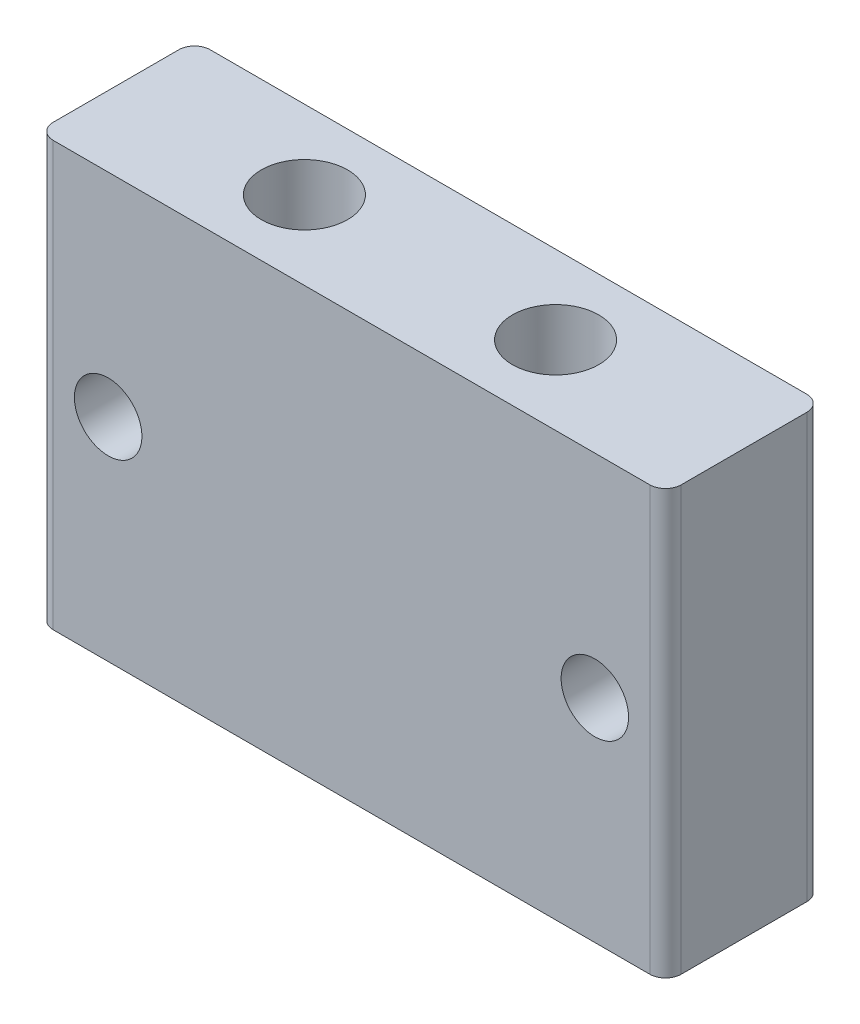
ISO-10303-21;
HEADER;
FILE_DESCRIPTION(('STEP AP214'),'2;1');
FILE_NAME('part.step','',(''),(''),'','','');
FILE_SCHEMA(('AUTOMOTIVE_DESIGN { 1 0 10303 214 1 1 1 1 }'));
ENDSEC;
DATA;
#1=APPLICATION_CONTEXT('core data for automotive mechanical design processes');
#2=APPLICATION_PROTOCOL_DEFINITION('international standard','automotive_design',2000,#1);
#3=PRODUCT_CONTEXT('',#1,'mechanical');
#4=PRODUCT('Part','Part','',(#3));
#5=PRODUCT_RELATED_PRODUCT_CATEGORY('part','',(#4));
#6=PRODUCT_DEFINITION_FORMATION('','',#4);
#7=PRODUCT_DEFINITION_CONTEXT('part definition',#1,'design');
#8=PRODUCT_DEFINITION('design','',#6,#7);
#9=PRODUCT_DEFINITION_SHAPE('','',#8);
#10=(LENGTH_UNIT() NAMED_UNIT(*) SI_UNIT(.MILLI.,.METRE.));
#11=(NAMED_UNIT(*) PLANE_ANGLE_UNIT() SI_UNIT($,.RADIAN.));
#12=(NAMED_UNIT(*) SI_UNIT($,.STERADIAN.) SOLID_ANGLE_UNIT());
#13=UNCERTAINTY_MEASURE_WITH_UNIT(LENGTH_MEASURE(1.E-05),#10,'distance_accuracy_value','');
#14=(GEOMETRIC_REPRESENTATION_CONTEXT(3) GLOBAL_UNCERTAINTY_ASSIGNED_CONTEXT((#13)) GLOBAL_UNIT_ASSIGNED_CONTEXT((#10,
#11,#12)) REPRESENTATION_CONTEXT('',''));
#15=CARTESIAN_POINT('',(0.,0.,0.));
#16=DIRECTION('',(0.,0.,1.));
#17=DIRECTION('',(1.,0.,0.));
#18=AXIS2_PLACEMENT_3D('',#15,#16,#17);
#19=CARTESIAN_POINT('',(0.,27.,0.));
#20=DIRECTION('',(1.,0.,0.));
#21=DIRECTION('',(0.,0.,-1.));
#22=AXIS2_PLACEMENT_3D('',#19,#20,#21);
#23=PLANE('',#22);
#24=DIRECTION('',(0.,0.,1.));
#25=VECTOR('',#24,1.);
#26=CARTESIAN_POINT('',(0.,27.,0.));
#27=LINE('',#26,#25);
#28=CARTESIAN_POINT('',(0.,27.,-9.));
#29=VERTEX_POINT('',#28);
#30=CARTESIAN_POINT('',(0.,27.,-1.));
#31=VERTEX_POINT('',#30);
#32=EDGE_CURVE('E129',#29,#31,#27,.T.);
#33=ORIENTED_EDGE('',*,*,#32,.F.);
#34=DIRECTION('',(0.,-1.,0.));
#35=VECTOR('',#34,1.);
#36=CARTESIAN_POINT('',(0.,27.,-9.));
#37=LINE('',#36,#35);
#38=CARTESIAN_POINT('',(0.,0.,-9.));
#39=VERTEX_POINT('',#38);
#40=EDGE_CURVE('E11',#29,#39,#37,.T.);
#41=ORIENTED_EDGE('',*,*,#40,.T.);
#42=DIRECTION('',(0.,0.,1.));
#43=VECTOR('',#42,1.);
#44=CARTESIAN_POINT('',(0.,0.,0.));
#45=LINE('',#44,#43);
#46=CARTESIAN_POINT('',(0.,0.,-1.));
#47=VERTEX_POINT('',#46);
#48=EDGE_CURVE('E145',#39,#47,#45,.T.);
#49=ORIENTED_EDGE('',*,*,#48,.T.);
#50=DIRECTION('',(0.,-1.,0.));
#51=VECTOR('',#50,1.);
#52=CARTESIAN_POINT('',(0.,27.,-1.));
#53=LINE('',#52,#51);
#54=EDGE_CURVE('E43',#47,#31,#53,.F.);
#55=ORIENTED_EDGE('',*,*,#54,.T.);
#56=EDGE_LOOP('',(#33,#41,#49,#55));
#57=FACE_BOUND('',#56,.T.);
#58=ADVANCED_FACE('F35',(#57),#23,.F.);
#59=CARTESIAN_POINT('',(0.,27.,0.));
#60=DIRECTION('',(0.,0.,-1.));
#61=DIRECTION('',(-1.,0.,0.));
#62=AXIS2_PLACEMENT_3D('',#59,#60,#61);
#63=PLANE('',#62);
#64=CARTESIAN_POINT('',(35.5,13.5,0.));
#65=DIRECTION('',(0.,0.,-1.));
#66=DIRECTION('',(-1.,0.,0.));
#67=AXIS2_PLACEMENT_3D('',#64,#65,#66);
#68=CIRCLE('',#67,2.15);
#69=CARTESIAN_POINT('',(33.35,13.5,0.));
#70=VERTEX_POINT('',#69);
#71=EDGE_CURVE('E142',#70,#70,#68,.T.);
#72=ORIENTED_EDGE('',*,*,#71,.T.);
#73=EDGE_LOOP('',(#72));
#74=FACE_BOUND('',#73,.T.);
#75=CARTESIAN_POINT('',(4.49999999999999,13.5,0.));
#76=DIRECTION('',(0.,0.,-1.));
#77=DIRECTION('',(-1.,0.,0.));
#78=AXIS2_PLACEMENT_3D('',#75,#76,#77);
#79=CIRCLE('',#78,2.15);
#80=CARTESIAN_POINT('',(2.34999999999999,13.5,0.));
#81=VERTEX_POINT('',#80);
#82=EDGE_CURVE('E181',#81,#81,#79,.T.);
#83=ORIENTED_EDGE('',*,*,#82,.T.);
#84=EDGE_LOOP('',(#83));
#85=FACE_BOUND('',#84,.T.);
#86=DIRECTION('',(1.,0.,0.));
#87=VECTOR('',#86,1.);
#88=CARTESIAN_POINT('',(0.,0.,0.));
#89=LINE('',#88,#87);
#90=CARTESIAN_POINT('',(1.,0.,0.));
#91=VERTEX_POINT('',#90);
#92=CARTESIAN_POINT('',(39.,0.,0.));
#93=VERTEX_POINT('',#92);
#94=EDGE_CURVE('E134',#91,#93,#89,.T.);
#95=ORIENTED_EDGE('',*,*,#94,.T.);
#96=DIRECTION('',(0.,-1.,0.));
#97=VECTOR('',#96,1.);
#98=CARTESIAN_POINT('',(39.,27.,0.));
#99=LINE('',#98,#97);
#100=CARTESIAN_POINT('',(39.,27.,0.));
#101=VERTEX_POINT('',#100);
#102=EDGE_CURVE('E50',#93,#101,#99,.F.);
#103=ORIENTED_EDGE('',*,*,#102,.T.);
#104=DIRECTION('',(1.,0.,0.));
#105=VECTOR('',#104,1.);
#106=CARTESIAN_POINT('',(0.,27.,0.));
#107=LINE('',#106,#105);
#108=CARTESIAN_POINT('',(1.,27.,0.));
#109=VERTEX_POINT('',#108);
#110=EDGE_CURVE('E132',#109,#101,#107,.T.);
#111=ORIENTED_EDGE('',*,*,#110,.F.);
#112=DIRECTION('',(0.,-1.,0.));
#113=VECTOR('',#112,1.);
#114=CARTESIAN_POINT('',(1.,27.,0.));
#115=LINE('',#114,#113);
#116=EDGE_CURVE('E160',#109,#91,#115,.T.);
#117=ORIENTED_EDGE('',*,*,#116,.T.);
#118=EDGE_LOOP('',(#95,#103,#111,#117));
#119=FACE_BOUND('',#118,.T.);
#120=ADVANCED_FACE('F174',(#74,#85,#119),#63,.F.);
#121=CARTESIAN_POINT('',(40.,27.,0.));
#122=DIRECTION('',(-1.,0.,0.));
#123=DIRECTION('',(0.,0.,1.));
#124=AXIS2_PLACEMENT_3D('',#121,#122,#123);
#125=PLANE('',#124);
#126=DIRECTION('',(0.,0.,-1.));
#127=VECTOR('',#126,1.);
#128=CARTESIAN_POINT('',(40.,0.,0.));
#129=LINE('',#128,#127);
#130=CARTESIAN_POINT('',(40.,0.,-1.));
#131=VERTEX_POINT('',#130);
#132=CARTESIAN_POINT('',(40.,0.,-9.));
#133=VERTEX_POINT('',#132);
#134=EDGE_CURVE('E130',#131,#133,#129,.T.);
#135=ORIENTED_EDGE('',*,*,#134,.T.);
#136=DIRECTION('',(0.,-1.,0.));
#137=VECTOR('',#136,1.);
#138=CARTESIAN_POINT('',(40.,27.,-9.));
#139=LINE('',#138,#137);
#140=CARTESIAN_POINT('',(40.,27.,-9.));
#141=VERTEX_POINT('',#140);
#142=EDGE_CURVE('E107',#133,#141,#139,.F.);
#143=ORIENTED_EDGE('',*,*,#142,.T.);
#144=DIRECTION('',(0.,0.,-1.));
#145=VECTOR('',#144,1.);
#146=CARTESIAN_POINT('',(40.,27.,0.));
#147=LINE('',#146,#145);
#148=CARTESIAN_POINT('',(40.,27.,-1.));
#149=VERTEX_POINT('',#148);
#150=EDGE_CURVE('E178',#149,#141,#147,.T.);
#151=ORIENTED_EDGE('',*,*,#150,.F.);
#152=DIRECTION('',(0.,-1.,0.));
#153=VECTOR('',#152,1.);
#154=CARTESIAN_POINT('',(40.,27.,-1.));
#155=LINE('',#154,#153);
#156=EDGE_CURVE('E112',#149,#131,#155,.T.);
#157=ORIENTED_EDGE('',*,*,#156,.T.);
#158=EDGE_LOOP('',(#135,#143,#151,#157));
#159=FACE_BOUND('',#158,.T.);
#160=ADVANCED_FACE('F227',(#159),#125,.F.);
#161=CARTESIAN_POINT('',(0.,27.,-10.));
#162=DIRECTION('',(0.,0.,1.));
#163=DIRECTION('',(1.,0.,0.));
#164=AXIS2_PLACEMENT_3D('',#161,#162,#163);
#165=PLANE('',#164);
#166=CARTESIAN_POINT('',(35.5,13.5,-10.));
#167=DIRECTION('',(0.,0.,1.));
#168=DIRECTION('',(1.,0.,0.));
#169=AXIS2_PLACEMENT_3D('',#166,#167,#168);
#170=CIRCLE('',#169,2.15);
#171=CARTESIAN_POINT('',(37.65,13.5,-10.));
#172=VERTEX_POINT('',#171);
#173=EDGE_CURVE('E141',#172,#172,#170,.T.);
#174=ORIENTED_EDGE('',*,*,#173,.T.);
#175=EDGE_LOOP('',(#174));
#176=FACE_BOUND('',#175,.T.);
#177=CARTESIAN_POINT('',(4.49999999999999,13.5,-10.));
#178=DIRECTION('',(0.,0.,1.));
#179=DIRECTION('',(1.,0.,0.));
#180=AXIS2_PLACEMENT_3D('',#177,#178,#179);
#181=CIRCLE('',#180,2.15);
#182=CARTESIAN_POINT('',(6.64999999999999,13.5,-10.));
#183=VERTEX_POINT('',#182);
#184=EDGE_CURVE('E138',#183,#183,#181,.T.);
#185=ORIENTED_EDGE('',*,*,#184,.T.);
#186=EDGE_LOOP('',(#185));
#187=FACE_BOUND('',#186,.T.);
#188=DIRECTION('',(-1.,0.,0.));
#189=VECTOR('',#188,1.);
#190=CARTESIAN_POINT('',(0.,27.,-10.));
#191=LINE('',#190,#189);
#192=CARTESIAN_POINT('',(39.,27.,-10.));
#193=VERTEX_POINT('',#192);
#194=CARTESIAN_POINT('',(1.,27.,-10.));
#195=VERTEX_POINT('',#194);
#196=EDGE_CURVE('E122',#193,#195,#191,.T.);
#197=ORIENTED_EDGE('',*,*,#196,.F.);
#198=DIRECTION('',(0.,-1.,0.));
#199=VECTOR('',#198,1.);
#200=CARTESIAN_POINT('',(39.,27.,-10.));
#201=LINE('',#200,#199);
#202=CARTESIAN_POINT('',(39.,0.,-10.));
#203=VERTEX_POINT('',#202);
#204=EDGE_CURVE('E106',#193,#203,#201,.T.);
#205=ORIENTED_EDGE('',*,*,#204,.T.);
#206=DIRECTION('',(-1.,0.,0.));
#207=VECTOR('',#206,1.);
#208=CARTESIAN_POINT('',(0.,0.,-10.));
#209=LINE('',#208,#207);
#210=CARTESIAN_POINT('',(1.,0.,-10.));
#211=VERTEX_POINT('',#210);
#212=EDGE_CURVE('E119',#203,#211,#209,.T.);
#213=ORIENTED_EDGE('',*,*,#212,.T.);
#214=DIRECTION('',(0.,-1.,0.));
#215=VECTOR('',#214,1.);
#216=CARTESIAN_POINT('',(1.,27.,-10.));
#217=LINE('',#216,#215);
#218=EDGE_CURVE('E124',#211,#195,#217,.F.);
#219=ORIENTED_EDGE('',*,*,#218,.T.);
#220=EDGE_LOOP('',(#197,#205,#213,#219));
#221=FACE_BOUND('',#220,.T.);
#222=ADVANCED_FACE('F118',(#176,#187,#221),#165,.F.);
#223=CARTESIAN_POINT('',(0.,27.,0.));
#224=DIRECTION('',(0.,-1.,0.));
#225=DIRECTION('',(0.,0.,-1.));
#226=AXIS2_PLACEMENT_3D('',#223,#224,#225);
#227=PLANE('',#226);
#228=CARTESIAN_POINT('',(12.,27.,-5.));
#229=DIRECTION('',(0.,-1.,0.));
#230=DIRECTION('',(0.,0.,-1.));
#231=AXIS2_PLACEMENT_3D('',#228,#229,#230);
#232=CIRCLE('',#231,2.75);
#233=CARTESIAN_POINT('',(12.,27.,-7.75));
#234=VERTEX_POINT('',#233);
#235=EDGE_CURVE('E184',#234,#234,#232,.T.);
#236=ORIENTED_EDGE('',*,*,#235,.T.);
#237=EDGE_LOOP('',(#236));
#238=FACE_BOUND('',#237,.T.);
#239=CARTESIAN_POINT('',(28.,27.,-5.00000000000001));
#240=DIRECTION('',(0.,-1.,0.));
#241=DIRECTION('',(0.,0.,-1.));
#242=AXIS2_PLACEMENT_3D('',#239,#240,#241);
#243=CIRCLE('',#242,2.74999999999999);
#244=CARTESIAN_POINT('',(28.,27.,-7.75));
#245=VERTEX_POINT('',#244);
#246=EDGE_CURVE('E189',#245,#245,#243,.T.);
#247=ORIENTED_EDGE('',*,*,#246,.T.);
#248=EDGE_LOOP('',(#247));
#249=FACE_BOUND('',#248,.T.);
#250=ORIENTED_EDGE('',*,*,#150,.T.);
#251=CARTESIAN_POINT('',(39.,27.,-9.));
#252=DIRECTION('',(0.,-1.,0.));
#253=DIRECTION('',(0.,0.,-1.));
#254=AXIS2_PLACEMENT_3D('',#251,#252,#253);
#255=CIRCLE('',#254,1.);
#256=EDGE_CURVE('E158',#141,#193,#255,.F.);
#257=ORIENTED_EDGE('',*,*,#256,.T.);
#258=ORIENTED_EDGE('',*,*,#196,.T.);
#259=CARTESIAN_POINT('',(1.,27.,-9.));
#260=DIRECTION('',(0.,-1.,0.));
#261=DIRECTION('',(0.,0.,-1.));
#262=AXIS2_PLACEMENT_3D('',#259,#260,#261);
#263=CIRCLE('',#262,1.);
#264=EDGE_CURVE('E154',#195,#29,#263,.F.);
#265=ORIENTED_EDGE('',*,*,#264,.T.);
#266=ORIENTED_EDGE('',*,*,#32,.T.);
#267=CARTESIAN_POINT('',(1.,27.,-1.));
#268=DIRECTION('',(0.,-1.,0.));
#269=DIRECTION('',(0.,0.,-1.));
#270=AXIS2_PLACEMENT_3D('',#267,#268,#269);
#271=CIRCLE('',#270,1.);
#272=EDGE_CURVE('E57',#31,#109,#271,.F.);
#273=ORIENTED_EDGE('',*,*,#272,.T.);
#274=ORIENTED_EDGE('',*,*,#110,.T.);
#275=CARTESIAN_POINT('',(39.,27.,-1.));
#276=DIRECTION('',(0.,-1.,0.));
#277=DIRECTION('',(0.,0.,-1.));
#278=AXIS2_PLACEMENT_3D('',#275,#276,#277);
#279=CIRCLE('',#278,1.);
#280=EDGE_CURVE('E156',#101,#149,#279,.F.);
#281=ORIENTED_EDGE('',*,*,#280,.T.);
#282=EDGE_LOOP('',(#250,#257,#258,#265,#266,#273,#274,#281));
#283=FACE_BOUND('',#282,.T.);
#284=ADVANCED_FACE('F170',(#238,#249,#283),#227,.F.);
#285=CARTESIAN_POINT('',(0.,0.,0.));
#286=DIRECTION('',(0.,-1.,0.));
#287=DIRECTION('',(0.,0.,-1.));
#288=AXIS2_PLACEMENT_3D('',#285,#286,#287);
#289=PLANE('',#288);
#290=CARTESIAN_POINT('',(12.,0.,-5.));
#291=DIRECTION('',(0.,1.,0.));
#292=DIRECTION('',(0.,0.,1.));
#293=AXIS2_PLACEMENT_3D('',#290,#291,#292);
#294=CIRCLE('',#293,2.75);
#295=CARTESIAN_POINT('',(12.,0.,-2.25000000000001));
#296=VERTEX_POINT('',#295);
#297=EDGE_CURVE('E192',#296,#296,#294,.T.);
#298=ORIENTED_EDGE('',*,*,#297,.T.);
#299=EDGE_LOOP('',(#298));
#300=FACE_BOUND('',#299,.T.);
#301=CARTESIAN_POINT('',(28.,0.,-5.00000000000001));
#302=DIRECTION('',(0.,1.,0.));
#303=DIRECTION('',(0.,0.,1.));
#304=AXIS2_PLACEMENT_3D('',#301,#302,#303);
#305=CIRCLE('',#304,2.74999999999999);
#306=CARTESIAN_POINT('',(28.,0.,-2.25000000000001));
#307=VERTEX_POINT('',#306);
#308=EDGE_CURVE('E193',#307,#307,#305,.T.);
#309=ORIENTED_EDGE('',*,*,#308,.T.);
#310=EDGE_LOOP('',(#309));
#311=FACE_BOUND('',#310,.T.);
#312=ORIENTED_EDGE('',*,*,#212,.F.);
#313=CARTESIAN_POINT('',(39.,0.,-9.));
#314=DIRECTION('',(0.,-1.,0.));
#315=DIRECTION('',(0.,0.,-1.));
#316=AXIS2_PLACEMENT_3D('',#313,#314,#315);
#317=CIRCLE('',#316,1.);
#318=EDGE_CURVE('E102',#203,#133,#317,.T.);
#319=ORIENTED_EDGE('',*,*,#318,.T.);
#320=ORIENTED_EDGE('',*,*,#134,.F.);
#321=CARTESIAN_POINT('',(39.,0.,-1.));
#322=DIRECTION('',(0.,-1.,0.));
#323=DIRECTION('',(0.,0.,-1.));
#324=AXIS2_PLACEMENT_3D('',#321,#322,#323);
#325=CIRCLE('',#324,1.);
#326=EDGE_CURVE('E113',#131,#93,#325,.T.);
#327=ORIENTED_EDGE('',*,*,#326,.T.);
#328=ORIENTED_EDGE('',*,*,#94,.F.);
#329=CARTESIAN_POINT('',(1.,0.,-1.));
#330=DIRECTION('',(0.,-1.,0.));
#331=DIRECTION('',(0.,0.,-1.));
#332=AXIS2_PLACEMENT_3D('',#329,#330,#331);
#333=CIRCLE('',#332,1.);
#334=EDGE_CURVE('E123',#91,#47,#333,.T.);
#335=ORIENTED_EDGE('',*,*,#334,.T.);
#336=ORIENTED_EDGE('',*,*,#48,.F.);
#337=CARTESIAN_POINT('',(1.,0.,-9.));
#338=DIRECTION('',(0.,-1.,0.));
#339=DIRECTION('',(0.,0.,-1.));
#340=AXIS2_PLACEMENT_3D('',#337,#338,#339);
#341=CIRCLE('',#340,1.);
#342=EDGE_CURVE('E128',#39,#211,#341,.T.);
#343=ORIENTED_EDGE('',*,*,#342,.T.);
#344=EDGE_LOOP('',(#312,#319,#320,#327,#328,#335,#336,#343));
#345=FACE_BOUND('',#344,.T.);
#346=ADVANCED_FACE('F126',(#300,#311,#345),#289,.T.);
#347=CARTESIAN_POINT('',(4.49999999999999,13.5,0.));
#348=DIRECTION('',(0.,0.,-1.));
#349=DIRECTION('',(-1.,0.,0.));
#350=AXIS2_PLACEMENT_3D('',#347,#348,#349);
#351=CYLINDRICAL_SURFACE('',#350,2.15);
#352=ORIENTED_EDGE('',*,*,#82,.F.);
#353=EDGE_LOOP('',(#352));
#354=FACE_BOUND('',#353,.T.);
#355=ORIENTED_EDGE('',*,*,#184,.F.);
#356=EDGE_LOOP('',(#355));
#357=FACE_BOUND('',#356,.T.);
#358=ADVANCED_FACE('F254',(#354,#357),#351,.F.);
#359=CARTESIAN_POINT('',(35.5,13.5,0.));
#360=DIRECTION('',(0.,0.,-1.));
#361=DIRECTION('',(-1.,0.,0.));
#362=AXIS2_PLACEMENT_3D('',#359,#360,#361);
#363=CYLINDRICAL_SURFACE('',#362,2.15);
#364=ORIENTED_EDGE('',*,*,#71,.F.);
#365=EDGE_LOOP('',(#364));
#366=FACE_BOUND('',#365,.T.);
#367=ORIENTED_EDGE('',*,*,#173,.F.);
#368=EDGE_LOOP('',(#367));
#369=FACE_BOUND('',#368,.T.);
#370=ADVANCED_FACE('F235',(#366,#369),#363,.F.);
#371=CARTESIAN_POINT('',(39.,27.,-9.));
#372=DIRECTION('',(0.,-1.,0.));
#373=DIRECTION('',(0.,0.,-1.));
#374=AXIS2_PLACEMENT_3D('',#371,#372,#373);
#375=CYLINDRICAL_SURFACE('',#374,1.);
#376=ORIENTED_EDGE('',*,*,#256,.F.);
#377=ORIENTED_EDGE('',*,*,#142,.F.);
#378=ORIENTED_EDGE('',*,*,#318,.F.);
#379=ORIENTED_EDGE('',*,*,#204,.F.);
#380=EDGE_LOOP('',(#376,#377,#378,#379));
#381=FACE_BOUND('',#380,.T.);
#382=ADVANCED_FACE('F105',(#381),#375,.T.);
#383=CARTESIAN_POINT('',(39.,27.,-1.));
#384=DIRECTION('',(0.,-1.,0.));
#385=DIRECTION('',(0.,0.,-1.));
#386=AXIS2_PLACEMENT_3D('',#383,#384,#385);
#387=CYLINDRICAL_SURFACE('',#386,1.);
#388=ORIENTED_EDGE('',*,*,#280,.F.);
#389=ORIENTED_EDGE('',*,*,#102,.F.);
#390=ORIENTED_EDGE('',*,*,#326,.F.);
#391=ORIENTED_EDGE('',*,*,#156,.F.);
#392=EDGE_LOOP('',(#388,#389,#390,#391));
#393=FACE_BOUND('',#392,.T.);
#394=ADVANCED_FACE('F234',(#393),#387,.T.);
#395=CARTESIAN_POINT('',(1.,27.,-9.));
#396=DIRECTION('',(0.,-1.,0.));
#397=DIRECTION('',(0.,0.,-1.));
#398=AXIS2_PLACEMENT_3D('',#395,#396,#397);
#399=CYLINDRICAL_SURFACE('',#398,1.);
#400=ORIENTED_EDGE('',*,*,#264,.F.);
#401=ORIENTED_EDGE('',*,*,#218,.F.);
#402=ORIENTED_EDGE('',*,*,#342,.F.);
#403=ORIENTED_EDGE('',*,*,#40,.F.);
#404=EDGE_LOOP('',(#400,#401,#402,#403));
#405=FACE_BOUND('',#404,.T.);
#406=ADVANCED_FACE('F219',(#405),#399,.T.);
#407=CARTESIAN_POINT('',(1.,27.,-1.));
#408=DIRECTION('',(0.,-1.,0.));
#409=DIRECTION('',(0.,0.,-1.));
#410=AXIS2_PLACEMENT_3D('',#407,#408,#409);
#411=CYLINDRICAL_SURFACE('',#410,1.);
#412=ORIENTED_EDGE('',*,*,#272,.F.);
#413=ORIENTED_EDGE('',*,*,#54,.F.);
#414=ORIENTED_EDGE('',*,*,#334,.F.);
#415=ORIENTED_EDGE('',*,*,#116,.F.);
#416=EDGE_LOOP('',(#412,#413,#414,#415));
#417=FACE_BOUND('',#416,.T.);
#418=ADVANCED_FACE('F37',(#417),#411,.T.);
#419=CARTESIAN_POINT('',(28.,0.,-5.00000000000001));
#420=DIRECTION('',(0.,1.,0.));
#421=DIRECTION('',(0.,0.,1.));
#422=AXIS2_PLACEMENT_3D('',#419,#420,#421);
#423=CYLINDRICAL_SURFACE('',#422,2.74999999999999);
#424=ORIENTED_EDGE('',*,*,#308,.F.);
#425=EDGE_LOOP('',(#424));
#426=FACE_BOUND('',#425,.T.);
#427=ORIENTED_EDGE('',*,*,#246,.F.);
#428=EDGE_LOOP('',(#427));
#429=FACE_BOUND('',#428,.T.);
#430=ADVANCED_FACE('F204',(#426,#429),#423,.F.);
#431=CARTESIAN_POINT('',(12.,0.,-5.));
#432=DIRECTION('',(0.,1.,0.));
#433=DIRECTION('',(0.,0.,1.));
#434=AXIS2_PLACEMENT_3D('',#431,#432,#433);
#435=CYLINDRICAL_SURFACE('',#434,2.75);
#436=ORIENTED_EDGE('',*,*,#297,.F.);
#437=EDGE_LOOP('',(#436));
#438=FACE_BOUND('',#437,.T.);
#439=ORIENTED_EDGE('',*,*,#235,.F.);
#440=EDGE_LOOP('',(#439));
#441=FACE_BOUND('',#440,.T.);
#442=ADVANCED_FACE('F201',(#438,#441),#435,.F.);
#443=CLOSED_SHELL('',(#58,#120,#160,#222,#284,#346,#358,#370,#382,#394,#406,#418,#430,#442));
#444=MANIFOLD_SOLID_BREP('B2',#443);
#445=ADVANCED_BREP_SHAPE_REPRESENTATION('',(#18,#444),#14);
#446=SHAPE_DEFINITION_REPRESENTATION(#9,#445);
ENDSEC;
END-ISO-10303-21;
